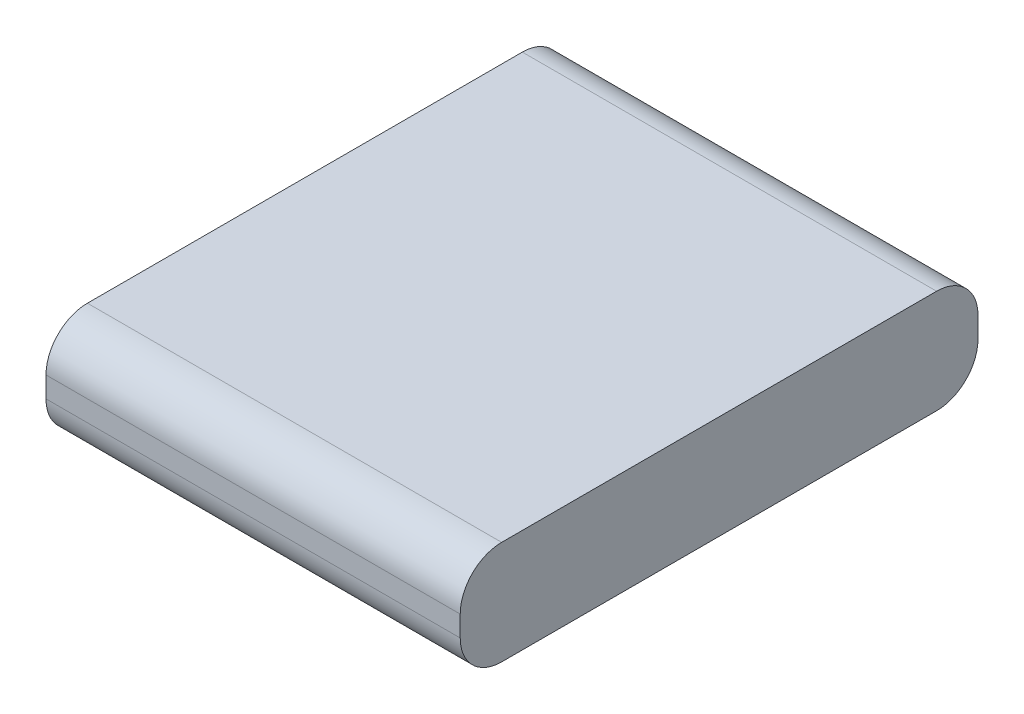
ISO-10303-21;
HEADER;
FILE_DESCRIPTION(('STEP AP214'),'2;1');
FILE_NAME('part.step','',(''),(''),'','','');
FILE_SCHEMA(('AUTOMOTIVE_DESIGN { 1 0 10303 214 1 1 1 1 }'));
ENDSEC;
DATA;
#1=APPLICATION_CONTEXT('core data for automotive mechanical design processes');
#2=APPLICATION_PROTOCOL_DEFINITION('international standard','automotive_design',2000,#1);
#3=PRODUCT_CONTEXT('',#1,'mechanical');
#4=PRODUCT('Part','Part','',(#3));
#5=PRODUCT_RELATED_PRODUCT_CATEGORY('part','',(#4));
#6=PRODUCT_DEFINITION_FORMATION('','',#4);
#7=PRODUCT_DEFINITION_CONTEXT('part definition',#1,'design');
#8=PRODUCT_DEFINITION('design','',#6,#7);
#9=PRODUCT_DEFINITION_SHAPE('','',#8);
#10=(LENGTH_UNIT() NAMED_UNIT(*) SI_UNIT(.MILLI.,.METRE.));
#11=(NAMED_UNIT(*) PLANE_ANGLE_UNIT() SI_UNIT($,.RADIAN.));
#12=(NAMED_UNIT(*) SI_UNIT($,.STERADIAN.) SOLID_ANGLE_UNIT());
#13=UNCERTAINTY_MEASURE_WITH_UNIT(LENGTH_MEASURE(1.E-05),#10,'distance_accuracy_value','');
#14=(GEOMETRIC_REPRESENTATION_CONTEXT(3) GLOBAL_UNCERTAINTY_ASSIGNED_CONTEXT((#13)) GLOBAL_UNIT_ASSIGNED_CONTEXT((#10,
#11,#12)) REPRESENTATION_CONTEXT('',''));
#15=CARTESIAN_POINT('',(0.,0.,0.));
#16=DIRECTION('',(0.,0.,1.));
#17=DIRECTION('',(1.,0.,0.));
#18=AXIS2_PLACEMENT_3D('',#15,#16,#17);
#19=CARTESIAN_POINT('',(0.,0.,500.));
#20=DIRECTION('',(1.,0.,0.));
#21=DIRECTION('',(0.,1.,0.));
#22=AXIS2_PLACEMENT_3D('',#19,#20,#21);
#23=PLANE('',#22);
#24=DIRECTION('',(0.,0.,-1.));
#25=VECTOR('',#24,1.);
#26=CARTESIAN_POINT('',(0.,-100.,500.));
#27=LINE('',#26,#25);
#28=CARTESIAN_POINT('',(0.,-100.,460.));
#29=VERTEX_POINT('',#28);
#30=CARTESIAN_POINT('',(0.,-100.,40.));
#31=VERTEX_POINT('',#30);
#32=EDGE_CURVE('E126',#29,#31,#27,.T.);
#33=ORIENTED_EDGE('',*,*,#32,.F.);
#34=CARTESIAN_POINT('',(0.,-60.,460.));
#35=DIRECTION('',(1.,0.,0.));
#36=DIRECTION('',(0.,1.,0.));
#37=AXIS2_PLACEMENT_3D('',#34,#35,#36);
#38=CIRCLE('',#37,40.);
#39=CARTESIAN_POINT('',(0.,-60.,500.));
#40=VERTEX_POINT('',#39);
#41=EDGE_CURVE('E112',#29,#40,#38,.F.);
#42=ORIENTED_EDGE('',*,*,#41,.T.);
#43=DIRECTION('',(0.,-1.,0.));
#44=VECTOR('',#43,1.);
#45=CARTESIAN_POINT('',(0.,0.,500.));
#46=LINE('',#45,#44);
#47=CARTESIAN_POINT('',(0.,-40.,500.));
#48=VERTEX_POINT('',#47);
#49=EDGE_CURVE('E120',#48,#40,#46,.T.);
#50=ORIENTED_EDGE('',*,*,#49,.F.);
#51=CARTESIAN_POINT('',(0.,-40.,460.));
#52=DIRECTION('',(1.,0.,0.));
#53=DIRECTION('',(0.,1.,0.));
#54=AXIS2_PLACEMENT_3D('',#51,#52,#53);
#55=CIRCLE('',#54,40.);
#56=CARTESIAN_POINT('',(0.,0.,460.));
#57=VERTEX_POINT('',#56);
#58=EDGE_CURVE('E63',#48,#57,#55,.F.);
#59=ORIENTED_EDGE('',*,*,#58,.T.);
#60=DIRECTION('',(0.,0.,-1.));
#61=VECTOR('',#60,1.);
#62=CARTESIAN_POINT('',(0.,0.,500.));
#63=LINE('',#62,#61);
#64=CARTESIAN_POINT('',(0.,0.,40.));
#65=VERTEX_POINT('',#64);
#66=EDGE_CURVE('E135',#57,#65,#63,.T.);
#67=ORIENTED_EDGE('',*,*,#66,.T.);
#68=CARTESIAN_POINT('',(0.,-40.,40.));
#69=DIRECTION('',(1.,0.,0.));
#70=DIRECTION('',(0.,1.,0.));
#71=AXIS2_PLACEMENT_3D('',#68,#69,#70);
#72=CIRCLE('',#71,40.);
#73=CARTESIAN_POINT('',(0.,-40.,0.));
#74=VERTEX_POINT('',#73);
#75=EDGE_CURVE('E55',#65,#74,#72,.F.);
#76=ORIENTED_EDGE('',*,*,#75,.T.);
#77=DIRECTION('',(0.,-1.,0.));
#78=VECTOR('',#77,1.);
#79=CARTESIAN_POINT('',(0.,0.,0.));
#80=LINE('',#79,#78);
#81=CARTESIAN_POINT('',(0.,-60.,0.));
#82=VERTEX_POINT('',#81);
#83=EDGE_CURVE('E138',#74,#82,#80,.T.);
#84=ORIENTED_EDGE('',*,*,#83,.T.);
#85=CARTESIAN_POINT('',(0.,-60.,40.));
#86=DIRECTION('',(1.,0.,0.));
#87=DIRECTION('',(0.,1.,0.));
#88=AXIS2_PLACEMENT_3D('',#85,#86,#87);
#89=CIRCLE('',#88,40.);
#90=EDGE_CURVE('E113',#82,#31,#89,.F.);
#91=ORIENTED_EDGE('',*,*,#90,.T.);
#92=EDGE_LOOP('',(#33,#42,#50,#59,#67,#76,#84,#91));
#93=FACE_BOUND('',#92,.T.);
#94=ADVANCED_FACE('F39',(#93),#23,.F.);
#95=CARTESIAN_POINT('',(0.,-100.,500.));
#96=DIRECTION('',(0.,1.,0.));
#97=DIRECTION('',(0.,0.,1.));
#98=AXIS2_PLACEMENT_3D('',#95,#96,#97);
#99=PLANE('',#98);
#100=DIRECTION('',(0.,0.,-1.));
#101=VECTOR('',#100,1.);
#102=CARTESIAN_POINT('',(400.,-100.,500.));
#103=LINE('',#102,#101);
#104=CARTESIAN_POINT('',(400.,-100.,460.));
#105=VERTEX_POINT('',#104);
#106=CARTESIAN_POINT('',(400.,-100.,40.));
#107=VERTEX_POINT('',#106);
#108=EDGE_CURVE('E150',#105,#107,#103,.T.);
#109=ORIENTED_EDGE('',*,*,#108,.F.);
#110=DIRECTION('',(1.,0.,0.));
#111=VECTOR('',#110,1.);
#112=CARTESIAN_POINT('',(0.,-100.,460.));
#113=LINE('',#112,#111);
#114=EDGE_CURVE('E175',#105,#29,#113,.F.);
#115=ORIENTED_EDGE('',*,*,#114,.T.);
#116=ORIENTED_EDGE('',*,*,#32,.T.);
#117=DIRECTION('',(1.,0.,0.));
#118=VECTOR('',#117,1.);
#119=CARTESIAN_POINT('',(0.,-100.,40.));
#120=LINE('',#119,#118);
#121=EDGE_CURVE('E171',#31,#107,#120,.T.);
#122=ORIENTED_EDGE('',*,*,#121,.T.);
#123=EDGE_LOOP('',(#109,#115,#116,#122));
#124=FACE_BOUND('',#123,.T.);
#125=ADVANCED_FACE('F206',(#124),#99,.F.);
#126=CARTESIAN_POINT('',(400.,0.,500.));
#127=DIRECTION('',(-1.,0.,0.));
#128=DIRECTION('',(0.,-1.,0.));
#129=AXIS2_PLACEMENT_3D('',#126,#127,#128);
#130=PLANE('',#129);
#131=DIRECTION('',(0.,1.,0.));
#132=VECTOR('',#131,1.);
#133=CARTESIAN_POINT('',(400.,0.,500.));
#134=LINE('',#133,#132);
#135=CARTESIAN_POINT('',(400.,-60.,500.));
#136=VERTEX_POINT('',#135);
#137=CARTESIAN_POINT('',(400.,-40.,500.));
#138=VERTEX_POINT('',#137);
#139=EDGE_CURVE('E123',#136,#138,#134,.T.);
#140=ORIENTED_EDGE('',*,*,#139,.F.);
#141=CARTESIAN_POINT('',(400.,-60.,460.));
#142=DIRECTION('',(-1.,0.,0.));
#143=DIRECTION('',(0.,-1.,0.));
#144=AXIS2_PLACEMENT_3D('',#141,#142,#143);
#145=CIRCLE('',#144,40.);
#146=EDGE_CURVE('E168',#136,#105,#145,.F.);
#147=ORIENTED_EDGE('',*,*,#146,.T.);
#148=ORIENTED_EDGE('',*,*,#108,.T.);
#149=CARTESIAN_POINT('',(400.,-60.,40.));
#150=DIRECTION('',(-1.,0.,0.));
#151=DIRECTION('',(0.,-1.,0.));
#152=AXIS2_PLACEMENT_3D('',#149,#150,#151);
#153=CIRCLE('',#152,40.);
#154=CARTESIAN_POINT('',(400.,-60.,0.));
#155=VERTEX_POINT('',#154);
#156=EDGE_CURVE('E162',#107,#155,#153,.F.);
#157=ORIENTED_EDGE('',*,*,#156,.T.);
#158=DIRECTION('',(0.,1.,0.));
#159=VECTOR('',#158,1.);
#160=CARTESIAN_POINT('',(400.,0.,0.));
#161=LINE('',#160,#159);
#162=CARTESIAN_POINT('',(400.,-40.,0.));
#163=VERTEX_POINT('',#162);
#164=EDGE_CURVE('E131',#155,#163,#161,.T.);
#165=ORIENTED_EDGE('',*,*,#164,.T.);
#166=CARTESIAN_POINT('',(400.,-40.,40.));
#167=DIRECTION('',(-1.,0.,0.));
#168=DIRECTION('',(0.,-1.,0.));
#169=AXIS2_PLACEMENT_3D('',#166,#167,#168);
#170=CIRCLE('',#169,40.);
#171=CARTESIAN_POINT('',(400.,0.,40.));
#172=VERTEX_POINT('',#171);
#173=EDGE_CURVE('E159',#163,#172,#170,.F.);
#174=ORIENTED_EDGE('',*,*,#173,.T.);
#175=DIRECTION('',(0.,0.,-1.));
#176=VECTOR('',#175,1.);
#177=CARTESIAN_POINT('',(400.,0.,500.));
#178=LINE('',#177,#176);
#179=CARTESIAN_POINT('',(400.,0.,460.));
#180=VERTEX_POINT('',#179);
#181=EDGE_CURVE('E146',#180,#172,#178,.T.);
#182=ORIENTED_EDGE('',*,*,#181,.F.);
#183=CARTESIAN_POINT('',(400.,-40.,460.));
#184=DIRECTION('',(-1.,0.,0.));
#185=DIRECTION('',(0.,-1.,0.));
#186=AXIS2_PLACEMENT_3D('',#183,#184,#185);
#187=CIRCLE('',#186,40.);
#188=EDGE_CURVE('E165',#180,#138,#187,.F.);
#189=ORIENTED_EDGE('',*,*,#188,.T.);
#190=EDGE_LOOP('',(#140,#147,#148,#157,#165,#174,#182,#189));
#191=FACE_BOUND('',#190,.T.);
#192=ADVANCED_FACE('F196',(#191),#130,.F.);
#193=CARTESIAN_POINT('',(0.,0.,500.));
#194=DIRECTION('',(0.,-1.,0.));
#195=DIRECTION('',(0.,0.,-1.));
#196=AXIS2_PLACEMENT_3D('',#193,#194,#195);
#197=PLANE('',#196);
#198=ORIENTED_EDGE('',*,*,#66,.F.);
#199=DIRECTION('',(-1.,0.,0.));
#200=VECTOR('',#199,1.);
#201=CARTESIAN_POINT('',(400.,0.,460.));
#202=LINE('',#201,#200);
#203=EDGE_CURVE('E110',#57,#180,#202,.F.);
#204=ORIENTED_EDGE('',*,*,#203,.T.);
#205=ORIENTED_EDGE('',*,*,#181,.T.);
#206=DIRECTION('',(-1.,0.,0.));
#207=VECTOR('',#206,1.);
#208=CARTESIAN_POINT('',(0.,0.,40.));
#209=LINE('',#208,#207);
#210=EDGE_CURVE('E184',#172,#65,#209,.T.);
#211=ORIENTED_EDGE('',*,*,#210,.T.);
#212=EDGE_LOOP('',(#198,#204,#205,#211));
#213=FACE_BOUND('',#212,.T.);
#214=ADVANCED_FACE('F199',(#213),#197,.F.);
#215=CARTESIAN_POINT('',(0.,0.,500.));
#216=DIRECTION('',(0.,0.,1.));
#217=DIRECTION('',(1.,0.,0.));
#218=AXIS2_PLACEMENT_3D('',#215,#216,#217);
#219=PLANE('',#218);
#220=ORIENTED_EDGE('',*,*,#49,.T.);
#221=DIRECTION('',(1.,0.,0.));
#222=VECTOR('',#221,1.);
#223=CARTESIAN_POINT('',(400.,-60.,500.));
#224=LINE('',#223,#222);
#225=EDGE_CURVE('E125',#40,#136,#224,.T.);
#226=ORIENTED_EDGE('',*,*,#225,.T.);
#227=ORIENTED_EDGE('',*,*,#139,.T.);
#228=DIRECTION('',(-1.,0.,0.));
#229=VECTOR('',#228,1.);
#230=CARTESIAN_POINT('',(0.,-40.,500.));
#231=LINE('',#230,#229);
#232=EDGE_CURVE('E109',#138,#48,#231,.T.);
#233=ORIENTED_EDGE('',*,*,#232,.T.);
#234=EDGE_LOOP('',(#220,#226,#227,#233));
#235=FACE_BOUND('',#234,.T.);
#236=ADVANCED_FACE('F118',(#235),#219,.T.);
#237=CARTESIAN_POINT('',(0.,0.,0.));
#238=DIRECTION('',(0.,0.,1.));
#239=DIRECTION('',(1.,0.,0.));
#240=AXIS2_PLACEMENT_3D('',#237,#238,#239);
#241=PLANE('',#240);
#242=ORIENTED_EDGE('',*,*,#164,.F.);
#243=DIRECTION('',(1.,0.,0.));
#244=VECTOR('',#243,1.);
#245=CARTESIAN_POINT('',(0.,-60.,0.));
#246=LINE('',#245,#244);
#247=EDGE_CURVE('E11',#155,#82,#246,.F.);
#248=ORIENTED_EDGE('',*,*,#247,.T.);
#249=ORIENTED_EDGE('',*,*,#83,.F.);
#250=DIRECTION('',(-1.,0.,0.));
#251=VECTOR('',#250,1.);
#252=CARTESIAN_POINT('',(0.,-40.,0.));
#253=LINE('',#252,#251);
#254=EDGE_CURVE('E48',#74,#163,#253,.F.);
#255=ORIENTED_EDGE('',*,*,#254,.T.);
#256=EDGE_LOOP('',(#242,#248,#249,#255));
#257=FACE_BOUND('',#256,.T.);
#258=ADVANCED_FACE('F192',(#257),#241,.F.);
#259=CARTESIAN_POINT('',(0.,-60.,460.));
#260=DIRECTION('',(-1.,0.,0.));
#261=DIRECTION('',(0.,0.,1.));
#262=AXIS2_PLACEMENT_3D('',#259,#260,#261);
#263=CYLINDRICAL_SURFACE('',#262,40.);
#264=ORIENTED_EDGE('',*,*,#41,.F.);
#265=ORIENTED_EDGE('',*,*,#114,.F.);
#266=ORIENTED_EDGE('',*,*,#146,.F.);
#267=ORIENTED_EDGE('',*,*,#225,.F.);
#268=EDGE_LOOP('',(#264,#265,#266,#267));
#269=FACE_BOUND('',#268,.T.);
#270=ADVANCED_FACE('F209',(#269),#263,.T.);
#271=CARTESIAN_POINT('',(0.,-40.,460.));
#272=DIRECTION('',(1.,0.,0.));
#273=DIRECTION('',(0.,0.,-1.));
#274=AXIS2_PLACEMENT_3D('',#271,#272,#273);
#275=CYLINDRICAL_SURFACE('',#274,40.);
#276=ORIENTED_EDGE('',*,*,#188,.F.);
#277=ORIENTED_EDGE('',*,*,#203,.F.);
#278=ORIENTED_EDGE('',*,*,#58,.F.);
#279=ORIENTED_EDGE('',*,*,#232,.F.);
#280=EDGE_LOOP('',(#276,#277,#278,#279));
#281=FACE_BOUND('',#280,.T.);
#282=ADVANCED_FACE('F108',(#281),#275,.T.);
#283=CARTESIAN_POINT('',(0.,-60.,40.));
#284=DIRECTION('',(1.,0.,0.));
#285=DIRECTION('',(0.,0.,-1.));
#286=AXIS2_PLACEMENT_3D('',#283,#284,#285);
#287=CYLINDRICAL_SURFACE('',#286,40.);
#288=ORIENTED_EDGE('',*,*,#90,.F.);
#289=ORIENTED_EDGE('',*,*,#247,.F.);
#290=ORIENTED_EDGE('',*,*,#156,.F.);
#291=ORIENTED_EDGE('',*,*,#121,.F.);
#292=EDGE_LOOP('',(#288,#289,#290,#291));
#293=FACE_BOUND('',#292,.T.);
#294=ADVANCED_FACE('F203',(#293),#287,.T.);
#295=CARTESIAN_POINT('',(0.,-40.,40.));
#296=DIRECTION('',(-1.,0.,0.));
#297=DIRECTION('',(0.,0.,1.));
#298=AXIS2_PLACEMENT_3D('',#295,#296,#297);
#299=CYLINDRICAL_SURFACE('',#298,40.);
#300=ORIENTED_EDGE('',*,*,#173,.F.);
#301=ORIENTED_EDGE('',*,*,#254,.F.);
#302=ORIENTED_EDGE('',*,*,#75,.F.);
#303=ORIENTED_EDGE('',*,*,#210,.F.);
#304=EDGE_LOOP('',(#300,#301,#302,#303));
#305=FACE_BOUND('',#304,.T.);
#306=ADVANCED_FACE('F41',(#305),#299,.T.);
#307=CLOSED_SHELL('',(#94,#125,#192,#214,#236,#258,#270,#282,#294,#306));
#308=MANIFOLD_SOLID_BREP('B2',#307);
#309=ADVANCED_BREP_SHAPE_REPRESENTATION('',(#18,#308),#14);
#310=SHAPE_DEFINITION_REPRESENTATION(#9,#309);
ENDSEC;
END-ISO-10303-21;
